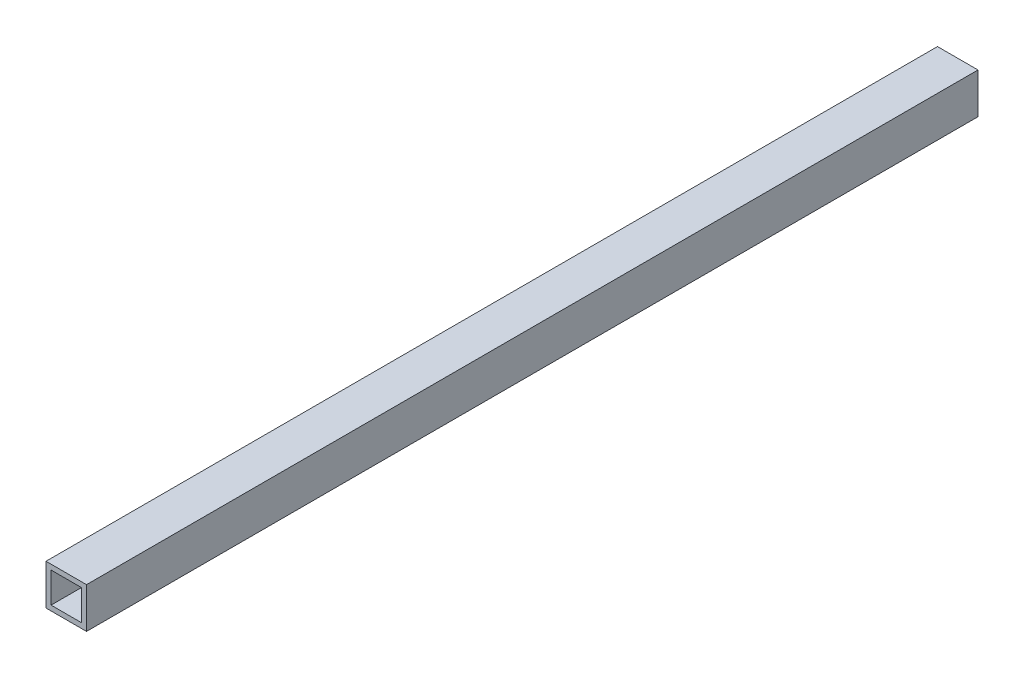
ISO-10303-21;
HEADER;
FILE_DESCRIPTION(('STEP AP214'),'2;1');
FILE_NAME('part.step','',(''),(''),'','','');
FILE_SCHEMA(('AUTOMOTIVE_DESIGN { 1 0 10303 214 1 1 1 1 }'));
ENDSEC;
DATA;
#1=APPLICATION_CONTEXT('core data for automotive mechanical design processes');
#2=APPLICATION_PROTOCOL_DEFINITION('international standard','automotive_design',2000,#1);
#3=PRODUCT_CONTEXT('',#1,'mechanical');
#4=PRODUCT('Part','Part','',(#3));
#5=PRODUCT_RELATED_PRODUCT_CATEGORY('part','',(#4));
#6=PRODUCT_DEFINITION_FORMATION('','',#4);
#7=PRODUCT_DEFINITION_CONTEXT('part definition',#1,'design');
#8=PRODUCT_DEFINITION('design','',#6,#7);
#9=PRODUCT_DEFINITION_SHAPE('','',#8);
#10=(LENGTH_UNIT() NAMED_UNIT(*) SI_UNIT(.MILLI.,.METRE.));
#11=(NAMED_UNIT(*) PLANE_ANGLE_UNIT() SI_UNIT($,.RADIAN.));
#12=(NAMED_UNIT(*) SI_UNIT($,.STERADIAN.) SOLID_ANGLE_UNIT());
#13=UNCERTAINTY_MEASURE_WITH_UNIT(LENGTH_MEASURE(1.E-05),#10,'distance_accuracy_value','');
#14=(GEOMETRIC_REPRESENTATION_CONTEXT(3) GLOBAL_UNCERTAINTY_ASSIGNED_CONTEXT((#13)) GLOBAL_UNIT_ASSIGNED_CONTEXT((#10,
#11,#12)) REPRESENTATION_CONTEXT('',''));
#15=CARTESIAN_POINT('',(0.,0.,0.));
#16=DIRECTION('',(0.,0.,1.));
#17=DIRECTION('',(1.,0.,0.));
#18=AXIS2_PLACEMENT_3D('',#15,#16,#17);
#19=CARTESIAN_POINT('',(0.,0.,558.8));
#20=DIRECTION('',(0.,0.,-1.));
#21=DIRECTION('',(-1.,0.,0.));
#22=AXIS2_PLACEMENT_3D('',#19,#20,#21);
#23=PLANE('',#22);
#24=DIRECTION('',(0.,-1.,0.));
#25=VECTOR('',#24,1.);
#26=CARTESIAN_POINT('',(0.,0.,558.8));
#27=LINE('',#26,#25);
#28=CARTESIAN_POINT('',(0.,25.4,558.8));
#29=VERTEX_POINT('',#28);
#30=CARTESIAN_POINT('',(0.,0.,558.8));
#31=VERTEX_POINT('',#30);
#32=EDGE_CURVE('E141',#29,#31,#27,.T.);
#33=ORIENTED_EDGE('',*,*,#32,.T.);
#34=DIRECTION('',(1.,0.,0.));
#35=VECTOR('',#34,1.);
#36=CARTESIAN_POINT('',(0.,0.,558.8));
#37=LINE('',#36,#35);
#38=CARTESIAN_POINT('',(25.4,0.,558.8));
#39=VERTEX_POINT('',#38);
#40=EDGE_CURVE('E144',#31,#39,#37,.T.);
#41=ORIENTED_EDGE('',*,*,#40,.T.);
#42=DIRECTION('',(0.,1.,0.));
#43=VECTOR('',#42,1.);
#44=CARTESIAN_POINT('',(25.4,0.,558.8));
#45=LINE('',#44,#43);
#46=CARTESIAN_POINT('',(25.4,25.4,558.8));
#47=VERTEX_POINT('',#46);
#48=EDGE_CURVE('E147',#39,#47,#45,.T.);
#49=ORIENTED_EDGE('',*,*,#48,.T.);
#50=DIRECTION('',(-1.,0.,0.));
#51=VECTOR('',#50,1.);
#52=CARTESIAN_POINT('',(0.,25.4,558.8));
#53=LINE('',#52,#51);
#54=EDGE_CURVE('E149',#47,#29,#53,.T.);
#55=ORIENTED_EDGE('',*,*,#54,.T.);
#56=EDGE_LOOP('',(#33,#41,#49,#55));
#57=FACE_BOUND('',#56,.T.);
#58=DIRECTION('',(1.,0.,0.));
#59=VECTOR('',#58,1.);
#60=CARTESIAN_POINT('',(3.175,3.175,558.8));
#61=LINE('',#60,#59);
#62=CARTESIAN_POINT('',(3.175,3.175,558.8));
#63=VERTEX_POINT('',#62);
#64=CARTESIAN_POINT('',(22.225,3.175,558.8));
#65=VERTEX_POINT('',#64);
#66=EDGE_CURVE('E105',#63,#65,#61,.T.);
#67=ORIENTED_EDGE('',*,*,#66,.F.);
#68=DIRECTION('',(0.,-1.,0.));
#69=VECTOR('',#68,1.);
#70=CARTESIAN_POINT('',(3.175,3.175,558.8));
#71=LINE('',#70,#69);
#72=CARTESIAN_POINT('',(3.175,22.225,558.8));
#73=VERTEX_POINT('',#72);
#74=EDGE_CURVE('E127',#73,#63,#71,.T.);
#75=ORIENTED_EDGE('',*,*,#74,.F.);
#76=DIRECTION('',(-1.,0.,0.));
#77=VECTOR('',#76,1.);
#78=CARTESIAN_POINT('',(3.175,22.225,558.8));
#79=LINE('',#78,#77);
#80=CARTESIAN_POINT('',(22.225,22.225,558.8));
#81=VERTEX_POINT('',#80);
#82=EDGE_CURVE('E125',#81,#73,#79,.T.);
#83=ORIENTED_EDGE('',*,*,#82,.F.);
#84=DIRECTION('',(0.,1.,0.));
#85=VECTOR('',#84,1.);
#86=CARTESIAN_POINT('',(22.225,3.175,558.8));
#87=LINE('',#86,#85);
#88=EDGE_CURVE('E113',#65,#81,#87,.T.);
#89=ORIENTED_EDGE('',*,*,#88,.F.);
#90=EDGE_LOOP('',(#67,#75,#83,#89));
#91=FACE_BOUND('',#90,.T.);
#92=ADVANCED_FACE('F40',(#57,#91),#23,.F.);
#93=CARTESIAN_POINT('',(0.,0.,0.));
#94=DIRECTION('',(0.,0.,-1.));
#95=DIRECTION('',(-1.,0.,0.));
#96=AXIS2_PLACEMENT_3D('',#93,#94,#95);
#97=PLANE('',#96);
#98=DIRECTION('',(0.,-1.,0.));
#99=VECTOR('',#98,1.);
#100=CARTESIAN_POINT('',(0.,0.,0.));
#101=LINE('',#100,#99);
#102=CARTESIAN_POINT('',(0.,25.4,0.));
#103=VERTEX_POINT('',#102);
#104=CARTESIAN_POINT('',(0.,0.,0.));
#105=VERTEX_POINT('',#104);
#106=EDGE_CURVE('E121',#103,#105,#101,.T.);
#107=ORIENTED_EDGE('',*,*,#106,.F.);
#108=DIRECTION('',(-1.,0.,0.));
#109=VECTOR('',#108,1.);
#110=CARTESIAN_POINT('',(0.,25.4,0.));
#111=LINE('',#110,#109);
#112=CARTESIAN_POINT('',(25.4,25.4,0.));
#113=VERTEX_POINT('',#112);
#114=EDGE_CURVE('E145',#113,#103,#111,.T.);
#115=ORIENTED_EDGE('',*,*,#114,.F.);
#116=DIRECTION('',(0.,1.,0.));
#117=VECTOR('',#116,1.);
#118=CARTESIAN_POINT('',(25.4,0.,0.));
#119=LINE('',#118,#117);
#120=CARTESIAN_POINT('',(25.4,0.,0.));
#121=VERTEX_POINT('',#120);
#122=EDGE_CURVE('E156',#121,#113,#119,.T.);
#123=ORIENTED_EDGE('',*,*,#122,.F.);
#124=DIRECTION('',(1.,0.,0.));
#125=VECTOR('',#124,1.);
#126=CARTESIAN_POINT('',(0.,0.,0.));
#127=LINE('',#126,#125);
#128=EDGE_CURVE('E154',#105,#121,#127,.T.);
#129=ORIENTED_EDGE('',*,*,#128,.F.);
#130=EDGE_LOOP('',(#107,#115,#123,#129));
#131=FACE_BOUND('',#130,.T.);
#132=DIRECTION('',(0.,-1.,0.));
#133=VECTOR('',#132,1.);
#134=CARTESIAN_POINT('',(3.175,3.175,0.));
#135=LINE('',#134,#133);
#136=CARTESIAN_POINT('',(3.175,22.225,0.));
#137=VERTEX_POINT('',#136);
#138=CARTESIAN_POINT('',(3.175,3.175,0.));
#139=VERTEX_POINT('',#138);
#140=EDGE_CURVE('E114',#137,#139,#135,.T.);
#141=ORIENTED_EDGE('',*,*,#140,.T.);
#142=DIRECTION('',(1.,0.,0.));
#143=VECTOR('',#142,1.);
#144=CARTESIAN_POINT('',(3.175,3.175,0.));
#145=LINE('',#144,#143);
#146=CARTESIAN_POINT('',(22.225,3.175,0.));
#147=VERTEX_POINT('',#146);
#148=EDGE_CURVE('E63',#139,#147,#145,.T.);
#149=ORIENTED_EDGE('',*,*,#148,.T.);
#150=DIRECTION('',(0.,1.,0.));
#151=VECTOR('',#150,1.);
#152=CARTESIAN_POINT('',(22.225,3.175,0.));
#153=LINE('',#152,#151);
#154=CARTESIAN_POINT('',(22.225,22.225,0.));
#155=VERTEX_POINT('',#154);
#156=EDGE_CURVE('E120',#147,#155,#153,.T.);
#157=ORIENTED_EDGE('',*,*,#156,.T.);
#158=DIRECTION('',(-1.,0.,0.));
#159=VECTOR('',#158,1.);
#160=CARTESIAN_POINT('',(3.175,22.225,0.));
#161=LINE('',#160,#159);
#162=EDGE_CURVE('E133',#155,#137,#161,.T.);
#163=ORIENTED_EDGE('',*,*,#162,.T.);
#164=EDGE_LOOP('',(#141,#149,#157,#163));
#165=FACE_BOUND('',#164,.T.);
#166=ADVANCED_FACE('F174',(#131,#165),#97,.T.);
#167=CARTESIAN_POINT('',(0.,0.,558.8));
#168=DIRECTION('',(1.,0.,0.));
#169=DIRECTION('',(0.,0.,-1.));
#170=AXIS2_PLACEMENT_3D('',#167,#168,#169);
#171=PLANE('',#170);
#172=ORIENTED_EDGE('',*,*,#106,.T.);
#173=DIRECTION('',(0.,0.,-1.));
#174=VECTOR('',#173,1.);
#175=CARTESIAN_POINT('',(0.,0.,558.8));
#176=LINE('',#175,#174);
#177=EDGE_CURVE('E11',#31,#105,#176,.T.);
#178=ORIENTED_EDGE('',*,*,#177,.F.);
#179=ORIENTED_EDGE('',*,*,#32,.F.);
#180=DIRECTION('',(0.,0.,-1.));
#181=VECTOR('',#180,1.);
#182=CARTESIAN_POINT('',(0.,25.4,558.8));
#183=LINE('',#182,#181);
#184=EDGE_CURVE('E151',#29,#103,#183,.T.);
#185=ORIENTED_EDGE('',*,*,#184,.T.);
#186=EDGE_LOOP('',(#172,#178,#179,#185));
#187=FACE_BOUND('',#186,.T.);
#188=ADVANCED_FACE('F42',(#187),#171,.F.);
#189=CARTESIAN_POINT('',(0.,0.,558.8));
#190=DIRECTION('',(0.,1.,0.));
#191=DIRECTION('',(0.,0.,1.));
#192=AXIS2_PLACEMENT_3D('',#189,#190,#191);
#193=PLANE('',#192);
#194=ORIENTED_EDGE('',*,*,#128,.T.);
#195=DIRECTION('',(0.,0.,-1.));
#196=VECTOR('',#195,1.);
#197=CARTESIAN_POINT('',(25.4,0.,558.8));
#198=LINE('',#197,#196);
#199=EDGE_CURVE('E48',#39,#121,#198,.T.);
#200=ORIENTED_EDGE('',*,*,#199,.F.);
#201=ORIENTED_EDGE('',*,*,#40,.F.);
#202=ORIENTED_EDGE('',*,*,#177,.T.);
#203=EDGE_LOOP('',(#194,#200,#201,#202));
#204=FACE_BOUND('',#203,.T.);
#205=ADVANCED_FACE('F184',(#204),#193,.F.);
#206=CARTESIAN_POINT('',(25.4,0.,558.8));
#207=DIRECTION('',(-1.,0.,0.));
#208=DIRECTION('',(0.,0.,1.));
#209=AXIS2_PLACEMENT_3D('',#206,#207,#208);
#210=PLANE('',#209);
#211=ORIENTED_EDGE('',*,*,#122,.T.);
#212=DIRECTION('',(0.,0.,-1.));
#213=VECTOR('',#212,1.);
#214=CARTESIAN_POINT('',(25.4,25.4,558.8));
#215=LINE('',#214,#213);
#216=EDGE_CURVE('E161',#47,#113,#215,.T.);
#217=ORIENTED_EDGE('',*,*,#216,.F.);
#218=ORIENTED_EDGE('',*,*,#48,.F.);
#219=ORIENTED_EDGE('',*,*,#199,.T.);
#220=EDGE_LOOP('',(#211,#217,#218,#219));
#221=FACE_BOUND('',#220,.T.);
#222=ADVANCED_FACE('F168',(#221),#210,.F.);
#223=CARTESIAN_POINT('',(0.,25.4,558.8));
#224=DIRECTION('',(0.,-1.,0.));
#225=DIRECTION('',(0.,0.,-1.));
#226=AXIS2_PLACEMENT_3D('',#223,#224,#225);
#227=PLANE('',#226);
#228=ORIENTED_EDGE('',*,*,#114,.T.);
#229=ORIENTED_EDGE('',*,*,#184,.F.);
#230=ORIENTED_EDGE('',*,*,#54,.F.);
#231=ORIENTED_EDGE('',*,*,#216,.T.);
#232=EDGE_LOOP('',(#228,#229,#230,#231));
#233=FACE_BOUND('',#232,.T.);
#234=ADVANCED_FACE('F178',(#233),#227,.F.);
#235=CARTESIAN_POINT('',(3.175,3.175,558.8));
#236=DIRECTION('',(0.,1.,0.));
#237=DIRECTION('',(0.,0.,1.));
#238=AXIS2_PLACEMENT_3D('',#235,#236,#237);
#239=PLANE('',#238);
#240=ORIENTED_EDGE('',*,*,#148,.F.);
#241=DIRECTION('',(0.,0.,-1.));
#242=VECTOR('',#241,1.);
#243=CARTESIAN_POINT('',(3.175,3.175,558.8));
#244=LINE('',#243,#242);
#245=EDGE_CURVE('E109',#63,#139,#244,.T.);
#246=ORIENTED_EDGE('',*,*,#245,.F.);
#247=ORIENTED_EDGE('',*,*,#66,.T.);
#248=DIRECTION('',(0.,0.,-1.));
#249=VECTOR('',#248,1.);
#250=CARTESIAN_POINT('',(22.225,3.175,558.8));
#251=LINE('',#250,#249);
#252=EDGE_CURVE('E108',#65,#147,#251,.T.);
#253=ORIENTED_EDGE('',*,*,#252,.T.);
#254=EDGE_LOOP('',(#240,#246,#247,#253));
#255=FACE_BOUND('',#254,.T.);
#256=ADVANCED_FACE('F107',(#255),#239,.T.);
#257=CARTESIAN_POINT('',(22.225,3.175,558.8));
#258=DIRECTION('',(-1.,0.,0.));
#259=DIRECTION('',(0.,-1.,0.));
#260=AXIS2_PLACEMENT_3D('',#257,#258,#259);
#261=PLANE('',#260);
#262=ORIENTED_EDGE('',*,*,#156,.F.);
#263=ORIENTED_EDGE('',*,*,#252,.F.);
#264=ORIENTED_EDGE('',*,*,#88,.T.);
#265=DIRECTION('',(0.,0.,-1.));
#266=VECTOR('',#265,1.);
#267=CARTESIAN_POINT('',(22.225,22.225,558.8));
#268=LINE('',#267,#266);
#269=EDGE_CURVE('E122',#81,#155,#268,.T.);
#270=ORIENTED_EDGE('',*,*,#269,.T.);
#271=EDGE_LOOP('',(#262,#263,#264,#270));
#272=FACE_BOUND('',#271,.T.);
#273=ADVANCED_FACE('F117',(#272),#261,.T.);
#274=CARTESIAN_POINT('',(3.175,22.225,558.8));
#275=DIRECTION('',(0.,-1.,0.));
#276=DIRECTION('',(1.,0.,0.));
#277=AXIS2_PLACEMENT_3D('',#274,#275,#276);
#278=PLANE('',#277);
#279=ORIENTED_EDGE('',*,*,#162,.F.);
#280=ORIENTED_EDGE('',*,*,#269,.F.);
#281=ORIENTED_EDGE('',*,*,#82,.T.);
#282=DIRECTION('',(0.,0.,-1.));
#283=VECTOR('',#282,1.);
#284=CARTESIAN_POINT('',(3.175,22.225,558.8));
#285=LINE('',#284,#283);
#286=EDGE_CURVE('E55',#73,#137,#285,.T.);
#287=ORIENTED_EDGE('',*,*,#286,.T.);
#288=EDGE_LOOP('',(#279,#280,#281,#287));
#289=FACE_BOUND('',#288,.T.);
#290=ADVANCED_FACE('F207',(#289),#278,.T.);
#291=CARTESIAN_POINT('',(3.175,3.175,558.8));
#292=DIRECTION('',(1.,0.,0.));
#293=DIRECTION('',(0.,0.,-1.));
#294=AXIS2_PLACEMENT_3D('',#291,#292,#293);
#295=PLANE('',#294);
#296=ORIENTED_EDGE('',*,*,#140,.F.);
#297=ORIENTED_EDGE('',*,*,#286,.F.);
#298=ORIENTED_EDGE('',*,*,#74,.T.);
#299=ORIENTED_EDGE('',*,*,#245,.T.);
#300=EDGE_LOOP('',(#296,#297,#298,#299));
#301=FACE_BOUND('',#300,.T.);
#302=ADVANCED_FACE('F211',(#301),#295,.T.);
#303=CLOSED_SHELL('',(#92,#166,#188,#205,#222,#234,#256,#273,#290,#302));
#304=MANIFOLD_SOLID_BREP('B2',#303);
#305=ADVANCED_BREP_SHAPE_REPRESENTATION('',(#18,#304),#14);
#306=SHAPE_DEFINITION_REPRESENTATION(#9,#305);
ENDSEC;
END-ISO-10303-21;
